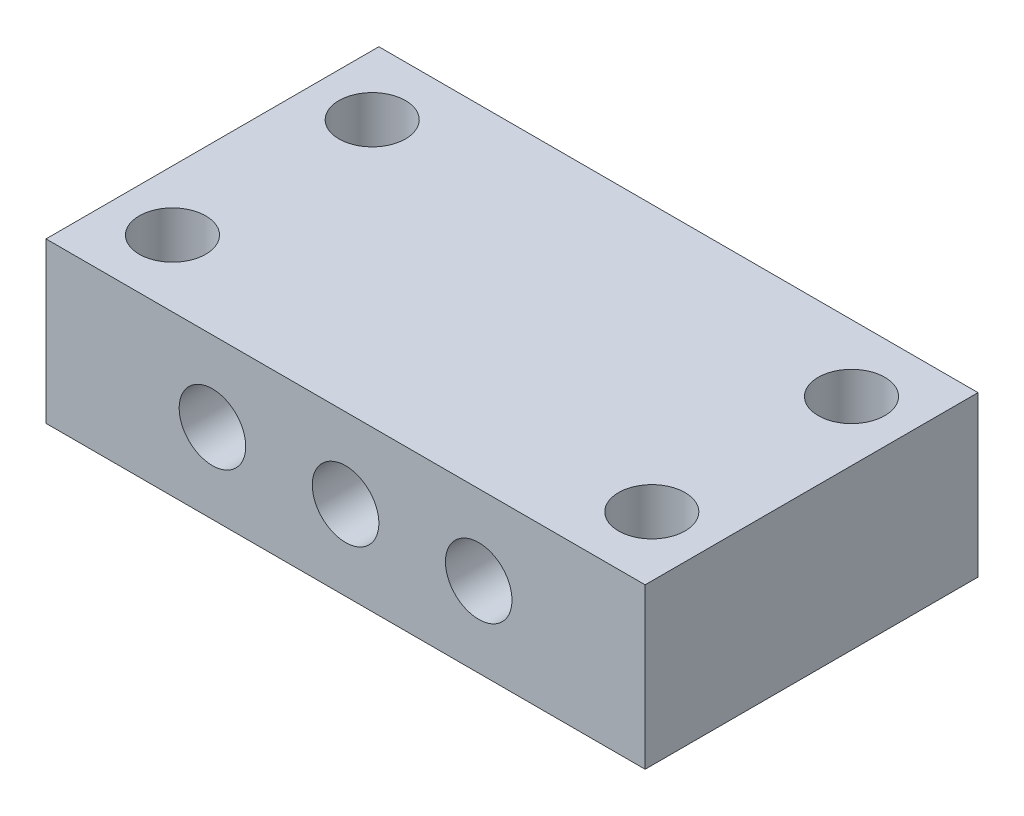
ISO-10303-21;
HEADER;
FILE_DESCRIPTION(('STEP AP214'),'2;1');
FILE_NAME('part.step','',(''),(''),'','','');
FILE_SCHEMA(('AUTOMOTIVE_DESIGN { 1 0 10303 214 1 1 1 1 }'));
ENDSEC;
DATA;
#1=APPLICATION_CONTEXT('core data for automotive mechanical design processes');
#2=APPLICATION_PROTOCOL_DEFINITION('international standard','automotive_design',2000,#1);
#3=PRODUCT_CONTEXT('',#1,'mechanical');
#4=PRODUCT('Part','Part','',(#3));
#5=PRODUCT_RELATED_PRODUCT_CATEGORY('part','',(#4));
#6=PRODUCT_DEFINITION_FORMATION('','',#4);
#7=PRODUCT_DEFINITION_CONTEXT('part definition',#1,'design');
#8=PRODUCT_DEFINITION('design','',#6,#7);
#9=PRODUCT_DEFINITION_SHAPE('','',#8);
#10=(LENGTH_UNIT() NAMED_UNIT(*) SI_UNIT(.MILLI.,.METRE.));
#11=(NAMED_UNIT(*) PLANE_ANGLE_UNIT() SI_UNIT($,.RADIAN.));
#12=(NAMED_UNIT(*) SI_UNIT($,.STERADIAN.) SOLID_ANGLE_UNIT());
#13=UNCERTAINTY_MEASURE_WITH_UNIT(LENGTH_MEASURE(1.E-05),#10,'distance_accuracy_value','');
#14=(GEOMETRIC_REPRESENTATION_CONTEXT(3) GLOBAL_UNCERTAINTY_ASSIGNED_CONTEXT((#13)) GLOBAL_UNIT_ASSIGNED_CONTEXT((#10,
#11,#12)) REPRESENTATION_CONTEXT('',''));
#15=CARTESIAN_POINT('',(0.,0.,0.));
#16=DIRECTION('',(0.,0.,1.));
#17=DIRECTION('',(1.,0.,0.));
#18=AXIS2_PLACEMENT_3D('',#15,#16,#17);
#19=CARTESIAN_POINT('',(22.5,12.,-12.5));
#20=DIRECTION('',(-1.,0.,0.));
#21=DIRECTION('',(0.,0.,1.));
#22=AXIS2_PLACEMENT_3D('',#19,#20,#21);
#23=PLANE('',#22);
#24=DIRECTION('',(0.,0.,-1.));
#25=VECTOR('',#24,1.);
#26=CARTESIAN_POINT('',(22.5,0.,-12.5));
#27=LINE('',#26,#25);
#28=CARTESIAN_POINT('',(22.5,0.,12.5));
#29=VERTEX_POINT('',#28);
#30=CARTESIAN_POINT('',(22.5,0.,-12.5));
#31=VERTEX_POINT('',#30);
#32=EDGE_CURVE('E99',#29,#31,#27,.T.);
#33=ORIENTED_EDGE('',*,*,#32,.T.);
#34=DIRECTION('',(0.,-1.,0.));
#35=VECTOR('',#34,1.);
#36=CARTESIAN_POINT('',(22.5,12.,-12.5));
#37=LINE('',#36,#35);
#38=CARTESIAN_POINT('',(22.5,12.,-12.5));
#39=VERTEX_POINT('',#38);
#40=EDGE_CURVE('E11',#39,#31,#37,.T.);
#41=ORIENTED_EDGE('',*,*,#40,.F.);
#42=DIRECTION('',(0.,0.,-1.));
#43=VECTOR('',#42,1.);
#44=CARTESIAN_POINT('',(22.5,12.,-12.5));
#45=LINE('',#44,#43);
#46=CARTESIAN_POINT('',(22.5,12.,12.5));
#47=VERTEX_POINT('',#46);
#48=EDGE_CURVE('E86',#47,#39,#45,.T.);
#49=ORIENTED_EDGE('',*,*,#48,.F.);
#50=DIRECTION('',(0.,-1.,0.));
#51=VECTOR('',#50,1.);
#52=CARTESIAN_POINT('',(22.5,12.,12.5));
#53=LINE('',#52,#51);
#54=EDGE_CURVE('E95',#47,#29,#53,.T.);
#55=ORIENTED_EDGE('',*,*,#54,.T.);
#56=EDGE_LOOP('',(#33,#41,#49,#55));
#57=FACE_BOUND('',#56,.T.);
#58=ADVANCED_FACE('F33',(#57),#23,.F.);
#59=CARTESIAN_POINT('',(-22.5,12.,-12.5));
#60=DIRECTION('',(0.,0.,1.));
#61=DIRECTION('',(1.,0.,0.));
#62=AXIS2_PLACEMENT_3D('',#59,#60,#61);
#63=PLANE('',#62);
#64=CARTESIAN_POINT('',(-10.,6.,-12.5));
#65=DIRECTION('',(0.,0.,-1.));
#66=DIRECTION('',(-1.,0.,0.));
#67=AXIS2_PLACEMENT_3D('',#64,#65,#66);
#68=CIRCLE('',#67,2.5);
#69=CARTESIAN_POINT('',(-12.5,6.,-12.5));
#70=VERTEX_POINT('',#69);
#71=EDGE_CURVE('E114',#70,#70,#68,.T.);
#72=ORIENTED_EDGE('',*,*,#71,.F.);
#73=EDGE_LOOP('',(#72));
#74=FACE_BOUND('',#73,.T.);
#75=CARTESIAN_POINT('',(10.,6.,-12.5));
#76=DIRECTION('',(0.,0.,-1.));
#77=DIRECTION('',(-1.,0.,0.));
#78=AXIS2_PLACEMENT_3D('',#75,#76,#77);
#79=CIRCLE('',#78,2.5);
#80=CARTESIAN_POINT('',(7.5,6.,-12.5));
#81=VERTEX_POINT('',#80);
#82=EDGE_CURVE('E119',#81,#81,#79,.T.);
#83=ORIENTED_EDGE('',*,*,#82,.F.);
#84=EDGE_LOOP('',(#83));
#85=FACE_BOUND('',#84,.T.);
#86=CARTESIAN_POINT('',(0.,6.,-12.5));
#87=DIRECTION('',(0.,0.,-1.));
#88=DIRECTION('',(-1.,0.,0.));
#89=AXIS2_PLACEMENT_3D('',#86,#87,#88);
#90=CIRCLE('',#89,2.5);
#91=CARTESIAN_POINT('',(-2.5,6.,-12.5));
#92=VERTEX_POINT('',#91);
#93=EDGE_CURVE('E111',#92,#92,#90,.T.);
#94=ORIENTED_EDGE('',*,*,#93,.F.);
#95=EDGE_LOOP('',(#94));
#96=FACE_BOUND('',#95,.T.);
#97=DIRECTION('',(-1.,0.,0.));
#98=VECTOR('',#97,1.);
#99=CARTESIAN_POINT('',(-22.5,0.,-12.5));
#100=LINE('',#99,#98);
#101=CARTESIAN_POINT('',(-22.5,0.,-12.5));
#102=VERTEX_POINT('',#101);
#103=EDGE_CURVE('E90',#31,#102,#100,.T.);
#104=ORIENTED_EDGE('',*,*,#103,.T.);
#105=DIRECTION('',(0.,-1.,0.));
#106=VECTOR('',#105,1.);
#107=CARTESIAN_POINT('',(-22.5,12.,-12.5));
#108=LINE('',#107,#106);
#109=CARTESIAN_POINT('',(-22.5,12.,-12.5));
#110=VERTEX_POINT('',#109);
#111=EDGE_CURVE('E42',#110,#102,#108,.T.);
#112=ORIENTED_EDGE('',*,*,#111,.F.);
#113=DIRECTION('',(-1.,0.,0.));
#114=VECTOR('',#113,1.);
#115=CARTESIAN_POINT('',(-22.5,12.,-12.5));
#116=LINE('',#115,#114);
#117=EDGE_CURVE('E81',#39,#110,#116,.T.);
#118=ORIENTED_EDGE('',*,*,#117,.F.);
#119=ORIENTED_EDGE('',*,*,#40,.T.);
#120=EDGE_LOOP('',(#104,#112,#118,#119));
#121=FACE_BOUND('',#120,.T.);
#122=ADVANCED_FACE('F89',(#74,#85,#96,#121),#63,.F.);
#123=CARTESIAN_POINT('',(-22.5,12.,-12.5));
#124=DIRECTION('',(1.,0.,0.));
#125=DIRECTION('',(0.,0.,-1.));
#126=AXIS2_PLACEMENT_3D('',#123,#124,#125);
#127=PLANE('',#126);
#128=DIRECTION('',(0.,0.,1.));
#129=VECTOR('',#128,1.);
#130=CARTESIAN_POINT('',(-22.5,0.,-12.5));
#131=LINE('',#130,#129);
#132=CARTESIAN_POINT('',(-22.5,0.,12.5));
#133=VERTEX_POINT('',#132);
#134=EDGE_CURVE('E68',#102,#133,#131,.T.);
#135=ORIENTED_EDGE('',*,*,#134,.T.);
#136=DIRECTION('',(0.,-1.,0.));
#137=VECTOR('',#136,1.);
#138=CARTESIAN_POINT('',(-22.5,12.,12.5));
#139=LINE('',#138,#137);
#140=CARTESIAN_POINT('',(-22.5,12.,12.5));
#141=VERTEX_POINT('',#140);
#142=EDGE_CURVE('E91',#141,#133,#139,.T.);
#143=ORIENTED_EDGE('',*,*,#142,.F.);
#144=DIRECTION('',(0.,0.,1.));
#145=VECTOR('',#144,1.);
#146=CARTESIAN_POINT('',(-22.5,12.,-12.5));
#147=LINE('',#146,#145);
#148=EDGE_CURVE('E84',#110,#141,#147,.T.);
#149=ORIENTED_EDGE('',*,*,#148,.F.);
#150=ORIENTED_EDGE('',*,*,#111,.T.);
#151=EDGE_LOOP('',(#135,#143,#149,#150));
#152=FACE_BOUND('',#151,.T.);
#153=ADVANCED_FACE('F93',(#152),#127,.F.);
#154=CARTESIAN_POINT('',(-22.5,12.,12.5));
#155=DIRECTION('',(0.,0.,-1.));
#156=DIRECTION('',(-1.,0.,0.));
#157=AXIS2_PLACEMENT_3D('',#154,#155,#156);
#158=PLANE('',#157);
#159=CARTESIAN_POINT('',(-10.,6.,12.5));
#160=DIRECTION('',(0.,0.,-1.));
#161=DIRECTION('',(-1.,0.,0.));
#162=AXIS2_PLACEMENT_3D('',#159,#160,#161);
#163=CIRCLE('',#162,2.5);
#164=CARTESIAN_POINT('',(-12.5,6.,12.5));
#165=VERTEX_POINT('',#164);
#166=EDGE_CURVE('E36',#165,#165,#163,.T.);
#167=ORIENTED_EDGE('',*,*,#166,.T.);
#168=EDGE_LOOP('',(#167));
#169=FACE_BOUND('',#168,.T.);
#170=CARTESIAN_POINT('',(10.,6.,12.5));
#171=DIRECTION('',(0.,0.,-1.));
#172=DIRECTION('',(-1.,0.,0.));
#173=AXIS2_PLACEMENT_3D('',#170,#171,#172);
#174=CIRCLE('',#173,2.5);
#175=CARTESIAN_POINT('',(7.5,6.,12.5));
#176=VERTEX_POINT('',#175);
#177=EDGE_CURVE('E112',#176,#176,#174,.T.);
#178=ORIENTED_EDGE('',*,*,#177,.T.);
#179=EDGE_LOOP('',(#178));
#180=FACE_BOUND('',#179,.T.);
#181=CARTESIAN_POINT('',(0.,6.,12.5));
#182=DIRECTION('',(0.,0.,-1.));
#183=DIRECTION('',(-1.,0.,0.));
#184=AXIS2_PLACEMENT_3D('',#181,#182,#183);
#185=CIRCLE('',#184,2.5);
#186=CARTESIAN_POINT('',(-2.5,6.,12.5));
#187=VERTEX_POINT('',#186);
#188=EDGE_CURVE('E108',#187,#187,#185,.T.);
#189=ORIENTED_EDGE('',*,*,#188,.T.);
#190=EDGE_LOOP('',(#189));
#191=FACE_BOUND('',#190,.T.);
#192=DIRECTION('',(1.,0.,0.));
#193=VECTOR('',#192,1.);
#194=CARTESIAN_POINT('',(-22.5,0.,12.5));
#195=LINE('',#194,#193);
#196=EDGE_CURVE('E74',#133,#29,#195,.T.);
#197=ORIENTED_EDGE('',*,*,#196,.T.);
#198=ORIENTED_EDGE('',*,*,#54,.F.);
#199=DIRECTION('',(1.,0.,0.));
#200=VECTOR('',#199,1.);
#201=CARTESIAN_POINT('',(-22.5,12.,12.5));
#202=LINE('',#201,#200);
#203=EDGE_CURVE('E51',#141,#47,#202,.T.);
#204=ORIENTED_EDGE('',*,*,#203,.F.);
#205=ORIENTED_EDGE('',*,*,#142,.T.);
#206=EDGE_LOOP('',(#197,#198,#204,#205));
#207=FACE_BOUND('',#206,.T.);
#208=ADVANCED_FACE('F155',(#169,#180,#191,#207),#158,.F.);
#209=CARTESIAN_POINT('',(0.,12.,0.));
#210=DIRECTION('',(0.,1.,0.));
#211=DIRECTION('',(0.,0.,1.));
#212=AXIS2_PLACEMENT_3D('',#209,#210,#211);
#213=PLANE('',#212);
#214=CARTESIAN_POINT('',(-18.,12.,-7.5));
#215=DIRECTION('',(0.,1.,0.));
#216=DIRECTION('',(0.,0.,1.));
#217=AXIS2_PLACEMENT_3D('',#214,#215,#216);
#218=CIRCLE('',#217,2.5);
#219=CARTESIAN_POINT('',(-18.,12.,-5.00000000000001));
#220=VERTEX_POINT('',#219);
#221=EDGE_CURVE('E138',#220,#220,#218,.T.);
#222=ORIENTED_EDGE('',*,*,#221,.F.);
#223=EDGE_LOOP('',(#222));
#224=FACE_BOUND('',#223,.T.);
#225=CARTESIAN_POINT('',(18.,12.,7.5));
#226=DIRECTION('',(0.,1.,0.));
#227=DIRECTION('',(0.,0.,1.));
#228=AXIS2_PLACEMENT_3D('',#225,#226,#227);
#229=CIRCLE('',#228,2.5);
#230=CARTESIAN_POINT('',(18.,12.,9.99999999999999));
#231=VERTEX_POINT('',#230);
#232=EDGE_CURVE('E131',#231,#231,#229,.T.);
#233=ORIENTED_EDGE('',*,*,#232,.F.);
#234=EDGE_LOOP('',(#233));
#235=FACE_BOUND('',#234,.T.);
#236=CARTESIAN_POINT('',(18.,12.,-7.5));
#237=DIRECTION('',(0.,1.,0.));
#238=DIRECTION('',(0.,0.,1.));
#239=AXIS2_PLACEMENT_3D('',#236,#237,#238);
#240=CIRCLE('',#239,2.5);
#241=CARTESIAN_POINT('',(18.,12.,-5.));
#242=VERTEX_POINT('',#241);
#243=EDGE_CURVE('E110',#242,#242,#240,.T.);
#244=ORIENTED_EDGE('',*,*,#243,.F.);
#245=EDGE_LOOP('',(#244));
#246=FACE_BOUND('',#245,.T.);
#247=CARTESIAN_POINT('',(-18.,12.,7.5));
#248=DIRECTION('',(0.,1.,0.));
#249=DIRECTION('',(0.,0.,1.));
#250=AXIS2_PLACEMENT_3D('',#247,#248,#249);
#251=CIRCLE('',#250,2.5);
#252=CARTESIAN_POINT('',(-18.,12.,9.99999999999999));
#253=VERTEX_POINT('',#252);
#254=EDGE_CURVE('E137',#253,#253,#251,.T.);
#255=ORIENTED_EDGE('',*,*,#254,.F.);
#256=EDGE_LOOP('',(#255));
#257=FACE_BOUND('',#256,.T.);
#258=ORIENTED_EDGE('',*,*,#48,.T.);
#259=ORIENTED_EDGE('',*,*,#117,.T.);
#260=ORIENTED_EDGE('',*,*,#148,.T.);
#261=ORIENTED_EDGE('',*,*,#203,.T.);
#262=EDGE_LOOP('',(#258,#259,#260,#261));
#263=FACE_BOUND('',#262,.T.);
#264=ADVANCED_FACE('F82',(#224,#235,#246,#257,#263),#213,.T.);
#265=CARTESIAN_POINT('',(0.,0.,0.));
#266=DIRECTION('',(0.,1.,0.));
#267=DIRECTION('',(0.,0.,1.));
#268=AXIS2_PLACEMENT_3D('',#265,#266,#267);
#269=PLANE('',#268);
#270=CARTESIAN_POINT('',(-18.,0.,-7.5));
#271=DIRECTION('',(0.,1.,0.));
#272=DIRECTION('',(0.,0.,1.));
#273=AXIS2_PLACEMENT_3D('',#270,#271,#272);
#274=CIRCLE('',#273,2.5);
#275=CARTESIAN_POINT('',(-18.,0.,-5.00000000000001));
#276=VERTEX_POINT('',#275);
#277=EDGE_CURVE('E134',#276,#276,#274,.T.);
#278=ORIENTED_EDGE('',*,*,#277,.T.);
#279=EDGE_LOOP('',(#278));
#280=FACE_BOUND('',#279,.T.);
#281=CARTESIAN_POINT('',(18.,0.,7.5));
#282=DIRECTION('',(0.,1.,0.));
#283=DIRECTION('',(0.,0.,1.));
#284=AXIS2_PLACEMENT_3D('',#281,#282,#283);
#285=CIRCLE('',#284,2.5);
#286=CARTESIAN_POINT('',(18.,0.,9.99999999999999));
#287=VERTEX_POINT('',#286);
#288=EDGE_CURVE('E141',#287,#287,#285,.T.);
#289=ORIENTED_EDGE('',*,*,#288,.T.);
#290=EDGE_LOOP('',(#289));
#291=FACE_BOUND('',#290,.T.);
#292=CARTESIAN_POINT('',(18.,0.,-7.5));
#293=DIRECTION('',(0.,1.,0.));
#294=DIRECTION('',(0.,0.,1.));
#295=AXIS2_PLACEMENT_3D('',#292,#293,#294);
#296=CIRCLE('',#295,2.5);
#297=CARTESIAN_POINT('',(18.,0.,-5.));
#298=VERTEX_POINT('',#297);
#299=EDGE_CURVE('E128',#298,#298,#296,.T.);
#300=ORIENTED_EDGE('',*,*,#299,.T.);
#301=EDGE_LOOP('',(#300));
#302=FACE_BOUND('',#301,.T.);
#303=CARTESIAN_POINT('',(-18.,0.,7.5));
#304=DIRECTION('',(0.,1.,0.));
#305=DIRECTION('',(0.,0.,1.));
#306=AXIS2_PLACEMENT_3D('',#303,#304,#305);
#307=CIRCLE('',#306,2.5);
#308=CARTESIAN_POINT('',(-18.,0.,9.99999999999999));
#309=VERTEX_POINT('',#308);
#310=EDGE_CURVE('E102',#309,#309,#307,.T.);
#311=ORIENTED_EDGE('',*,*,#310,.T.);
#312=EDGE_LOOP('',(#311));
#313=FACE_BOUND('',#312,.T.);
#314=ORIENTED_EDGE('',*,*,#32,.F.);
#315=ORIENTED_EDGE('',*,*,#196,.F.);
#316=ORIENTED_EDGE('',*,*,#134,.F.);
#317=ORIENTED_EDGE('',*,*,#103,.F.);
#318=EDGE_LOOP('',(#314,#315,#316,#317));
#319=FACE_BOUND('',#318,.T.);
#320=ADVANCED_FACE('F154',(#280,#291,#302,#313,#319),#269,.F.);
#321=CARTESIAN_POINT('',(-18.,0.,7.5));
#322=DIRECTION('',(0.,1.,0.));
#323=DIRECTION('',(0.,0.,1.));
#324=AXIS2_PLACEMENT_3D('',#321,#322,#323);
#325=CYLINDRICAL_SURFACE('',#324,2.5);
#326=ORIENTED_EDGE('',*,*,#310,.F.);
#327=EDGE_LOOP('',(#326));
#328=FACE_BOUND('',#327,.T.);
#329=ORIENTED_EDGE('',*,*,#254,.T.);
#330=EDGE_LOOP('',(#329));
#331=FACE_BOUND('',#330,.T.);
#332=ADVANCED_FACE('F151',(#328,#331),#325,.F.);
#333=CARTESIAN_POINT('',(18.,0.,-7.5));
#334=DIRECTION('',(0.,1.,0.));
#335=DIRECTION('',(0.,0.,1.));
#336=AXIS2_PLACEMENT_3D('',#333,#334,#335);
#337=CYLINDRICAL_SURFACE('',#336,2.5);
#338=ORIENTED_EDGE('',*,*,#299,.F.);
#339=EDGE_LOOP('',(#338));
#340=FACE_BOUND('',#339,.T.);
#341=ORIENTED_EDGE('',*,*,#243,.T.);
#342=EDGE_LOOP('',(#341));
#343=FACE_BOUND('',#342,.T.);
#344=ADVANCED_FACE('F207',(#340,#343),#337,.F.);
#345=CARTESIAN_POINT('',(18.,0.,7.5));
#346=DIRECTION('',(0.,1.,0.));
#347=DIRECTION('',(0.,0.,1.));
#348=AXIS2_PLACEMENT_3D('',#345,#346,#347);
#349=CYLINDRICAL_SURFACE('',#348,2.5);
#350=ORIENTED_EDGE('',*,*,#288,.F.);
#351=EDGE_LOOP('',(#350));
#352=FACE_BOUND('',#351,.T.);
#353=ORIENTED_EDGE('',*,*,#232,.T.);
#354=EDGE_LOOP('',(#353));
#355=FACE_BOUND('',#354,.T.);
#356=ADVANCED_FACE('F202',(#352,#355),#349,.F.);
#357=CARTESIAN_POINT('',(-18.,0.,-7.5));
#358=DIRECTION('',(0.,1.,0.));
#359=DIRECTION('',(0.,0.,1.));
#360=AXIS2_PLACEMENT_3D('',#357,#358,#359);
#361=CYLINDRICAL_SURFACE('',#360,2.5);
#362=ORIENTED_EDGE('',*,*,#277,.F.);
#363=EDGE_LOOP('',(#362));
#364=FACE_BOUND('',#363,.T.);
#365=ORIENTED_EDGE('',*,*,#221,.T.);
#366=EDGE_LOOP('',(#365));
#367=FACE_BOUND('',#366,.T.);
#368=ADVANCED_FACE('F192',(#364,#367),#361,.F.);
#369=CARTESIAN_POINT('',(0.,6.,59.5));
#370=DIRECTION('',(0.,0.,-1.));
#371=DIRECTION('',(-1.,0.,0.));
#372=AXIS2_PLACEMENT_3D('',#369,#370,#371);
#373=CYLINDRICAL_SURFACE('',#372,2.5);
#374=ORIENTED_EDGE('',*,*,#93,.T.);
#375=EDGE_LOOP('',(#374));
#376=FACE_BOUND('',#375,.T.);
#377=ORIENTED_EDGE('',*,*,#188,.F.);
#378=EDGE_LOOP('',(#377));
#379=FACE_BOUND('',#378,.T.);
#380=ADVANCED_FACE('F188',(#376,#379),#373,.F.);
#381=CARTESIAN_POINT('',(10.,6.,59.5));
#382=DIRECTION('',(0.,0.,-1.));
#383=DIRECTION('',(-1.,0.,0.));
#384=AXIS2_PLACEMENT_3D('',#381,#382,#383);
#385=CYLINDRICAL_SURFACE('',#384,2.5);
#386=ORIENTED_EDGE('',*,*,#82,.T.);
#387=EDGE_LOOP('',(#386));
#388=FACE_BOUND('',#387,.T.);
#389=ORIENTED_EDGE('',*,*,#177,.F.);
#390=EDGE_LOOP('',(#389));
#391=FACE_BOUND('',#390,.T.);
#392=ADVANCED_FACE('F191',(#388,#391),#385,.F.);
#393=CARTESIAN_POINT('',(-10.,6.,59.5));
#394=DIRECTION('',(0.,0.,-1.));
#395=DIRECTION('',(-1.,0.,0.));
#396=AXIS2_PLACEMENT_3D('',#393,#394,#395);
#397=CYLINDRICAL_SURFACE('',#396,2.5);
#398=ORIENTED_EDGE('',*,*,#71,.T.);
#399=EDGE_LOOP('',(#398));
#400=FACE_BOUND('',#399,.T.);
#401=ORIENTED_EDGE('',*,*,#166,.F.);
#402=EDGE_LOOP('',(#401));
#403=FACE_BOUND('',#402,.T.);
#404=ADVANCED_FACE('F199',(#400,#403),#397,.F.);
#405=CLOSED_SHELL('',(#58,#122,#153,#208,#264,#320,#332,#344,#356,#368,#380,#392,#404));
#406=MANIFOLD_SOLID_BREP('B2',#405);
#407=ADVANCED_BREP_SHAPE_REPRESENTATION('',(#18,#406),#14);
#408=SHAPE_DEFINITION_REPRESENTATION(#9,#407);
ENDSEC;
END-ISO-10303-21;
